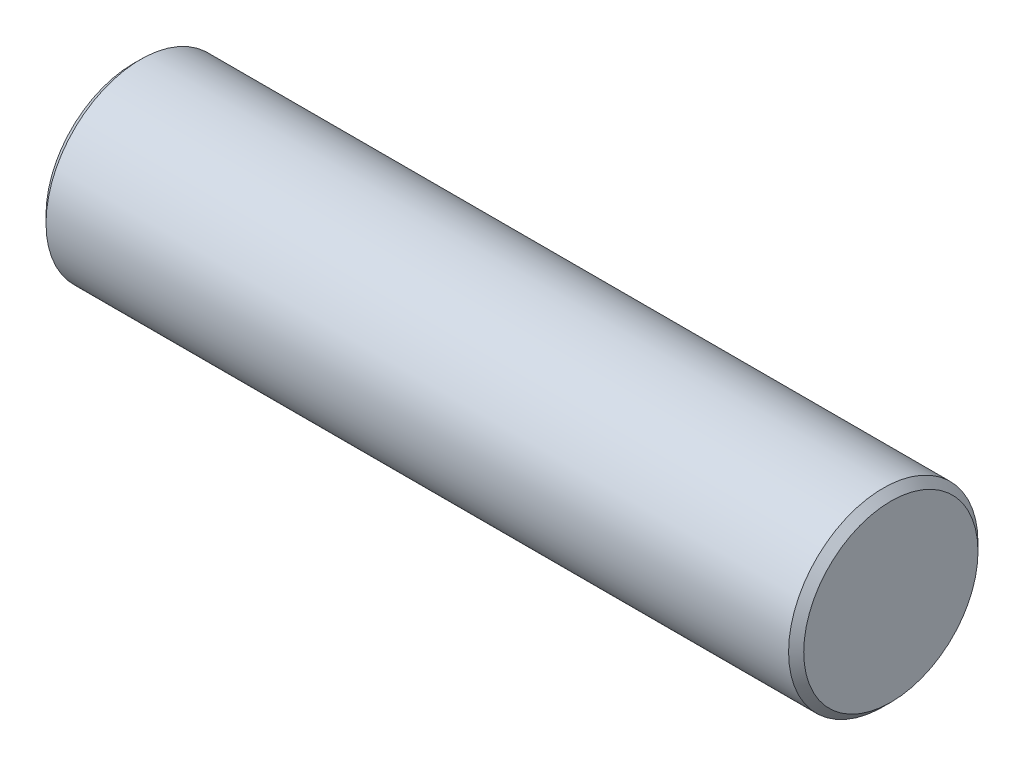
ISO-10303-21;
HEADER;
FILE_DESCRIPTION(('STEP AP214'),'2;1');
FILE_NAME('part.step','',(''),(''),'','','');
FILE_SCHEMA(('AUTOMOTIVE_DESIGN { 1 0 10303 214 1 1 1 1 }'));
ENDSEC;
DATA;
#1=APPLICATION_CONTEXT('core data for automotive mechanical design processes');
#2=APPLICATION_PROTOCOL_DEFINITION('international standard','automotive_design',2000,#1);
#3=PRODUCT_CONTEXT('',#1,'mechanical');
#4=PRODUCT('Part','Part','',(#3));
#5=PRODUCT_RELATED_PRODUCT_CATEGORY('part','',(#4));
#6=PRODUCT_DEFINITION_FORMATION('','',#4);
#7=PRODUCT_DEFINITION_CONTEXT('part definition',#1,'design');
#8=PRODUCT_DEFINITION('design','',#6,#7);
#9=PRODUCT_DEFINITION_SHAPE('','',#8);
#10=(LENGTH_UNIT() NAMED_UNIT(*) SI_UNIT(.MILLI.,.METRE.));
#11=(NAMED_UNIT(*) PLANE_ANGLE_UNIT() SI_UNIT($,.RADIAN.));
#12=(NAMED_UNIT(*) SI_UNIT($,.STERADIAN.) SOLID_ANGLE_UNIT());
#13=UNCERTAINTY_MEASURE_WITH_UNIT(LENGTH_MEASURE(1.E-05),#10,'distance_accuracy_value','');
#14=(GEOMETRIC_REPRESENTATION_CONTEXT(3) GLOBAL_UNCERTAINTY_ASSIGNED_CONTEXT((#13)) GLOBAL_UNIT_ASSIGNED_CONTEXT((#10,
#11,#12)) REPRESENTATION_CONTEXT('',''));
#15=CARTESIAN_POINT('',(0.,0.,0.));
#16=DIRECTION('',(0.,0.,1.));
#17=DIRECTION('',(1.,0.,0.));
#18=AXIS2_PLACEMENT_3D('',#15,#16,#17);
#19=CARTESIAN_POINT('',(12.7,0.,0.));
#20=DIRECTION('',(-1.,0.,0.));
#21=DIRECTION('',(0.,0.,1.));
#22=AXIS2_PLACEMENT_3D('',#19,#20,#21);
#23=CYLINDRICAL_SURFACE('',#22,3.175);
#24=CARTESIAN_POINT('',(12.446,0.,0.));
#25=DIRECTION('',(1.,0.,0.));
#26=DIRECTION('',(0.,0.,-1.));
#27=AXIS2_PLACEMENT_3D('',#24,#25,#26);
#28=CIRCLE('',#27,3.175);
#29=CARTESIAN_POINT('',(12.446,0.,-3.175));
#30=VERTEX_POINT('',#29);
#31=EDGE_CURVE('E39',#30,#30,#28,.F.);
#32=ORIENTED_EDGE('',*,*,#31,.T.);
#33=EDGE_LOOP('',(#32));
#34=FACE_BOUND('',#33,.T.);
#35=CARTESIAN_POINT('',(-12.446,0.,0.));
#36=DIRECTION('',(1.,0.,0.));
#37=DIRECTION('',(0.,0.,-1.));
#38=AXIS2_PLACEMENT_3D('',#35,#36,#37);
#39=CIRCLE('',#38,3.175);
#40=CARTESIAN_POINT('',(-12.446,0.,-3.175));
#41=VERTEX_POINT('',#40);
#42=EDGE_CURVE('E43',#41,#41,#39,.T.);
#43=ORIENTED_EDGE('',*,*,#42,.T.);
#44=EDGE_LOOP('',(#43));
#45=FACE_BOUND('',#44,.T.);
#46=ADVANCED_FACE('F32',(#34,#45),#23,.T.);
#47=CARTESIAN_POINT('',(12.7,0.,0.));
#48=DIRECTION('',(1.,0.,0.));
#49=DIRECTION('',(0.,0.,-1.));
#50=AXIS2_PLACEMENT_3D('',#47,#48,#49);
#51=PLANE('',#50);
#52=CARTESIAN_POINT('',(12.7,0.,0.));
#53=DIRECTION('',(1.,0.,0.));
#54=DIRECTION('',(0.,0.,-1.));
#55=AXIS2_PLACEMENT_3D('',#52,#53,#54);
#56=CIRCLE('',#55,2.921);
#57=CARTESIAN_POINT('',(12.7,0.,-2.921));
#58=VERTEX_POINT('',#57);
#59=EDGE_CURVE('E47',#58,#58,#56,.T.);
#60=ORIENTED_EDGE('',*,*,#59,.T.);
#61=EDGE_LOOP('',(#60));
#62=FACE_BOUND('',#61,.T.);
#63=ADVANCED_FACE('F53',(#62),#51,.T.);
#64=CARTESIAN_POINT('',(-12.7,0.,0.));
#65=DIRECTION('',(1.,0.,0.));
#66=DIRECTION('',(0.,0.,-1.));
#67=AXIS2_PLACEMENT_3D('',#64,#65,#66);
#68=PLANE('',#67);
#69=CARTESIAN_POINT('',(-12.7,0.,0.));
#70=DIRECTION('',(1.,0.,0.));
#71=DIRECTION('',(0.,0.,-1.));
#72=AXIS2_PLACEMENT_3D('',#69,#70,#71);
#73=CIRCLE('',#72,2.921);
#74=CARTESIAN_POINT('',(-12.7,0.,-2.921));
#75=VERTEX_POINT('',#74);
#76=EDGE_CURVE('E10',#75,#75,#73,.F.);
#77=ORIENTED_EDGE('',*,*,#76,.T.);
#78=EDGE_LOOP('',(#77));
#79=FACE_BOUND('',#78,.T.);
#80=ADVANCED_FACE('F57',(#79),#68,.F.);
#81=CARTESIAN_POINT('',(12.7,0.,0.));
#82=DIRECTION('',(-1.,0.,0.));
#83=DIRECTION('',(0.,0.,1.));
#84=AXIS2_PLACEMENT_3D('',#81,#82,#83);
#85=CONICAL_SURFACE('',#84,2.921,0.785398163397445);
#86=ORIENTED_EDGE('',*,*,#31,.F.);
#87=EDGE_LOOP('',(#86));
#88=FACE_BOUND('',#87,.T.);
#89=ORIENTED_EDGE('',*,*,#59,.F.);
#90=EDGE_LOOP('',(#89));
#91=FACE_BOUND('',#90,.T.);
#92=ADVANCED_FACE('F55',(#88,#91),#85,.T.);
#93=CARTESIAN_POINT('',(-12.446,0.,0.));
#94=DIRECTION('',(1.,0.,0.));
#95=DIRECTION('',(0.,0.,-1.));
#96=AXIS2_PLACEMENT_3D('',#93,#94,#95);
#97=CONICAL_SURFACE('',#96,3.175,0.785398163397457);
#98=ORIENTED_EDGE('',*,*,#76,.F.);
#99=EDGE_LOOP('',(#98));
#100=FACE_BOUND('',#99,.T.);
#101=ORIENTED_EDGE('',*,*,#42,.F.);
#102=EDGE_LOOP('',(#101));
#103=FACE_BOUND('',#102,.T.);
#104=ADVANCED_FACE('F34',(#100,#103),#97,.T.);
#105=CLOSED_SHELL('',(#46,#63,#80,#92,#104));
#106=MANIFOLD_SOLID_BREP('B2',#105);
#107=ADVANCED_BREP_SHAPE_REPRESENTATION('',(#18,#106),#14);
#108=SHAPE_DEFINITION_REPRESENTATION(#9,#107);
ENDSEC;
END-ISO-10303-21;
